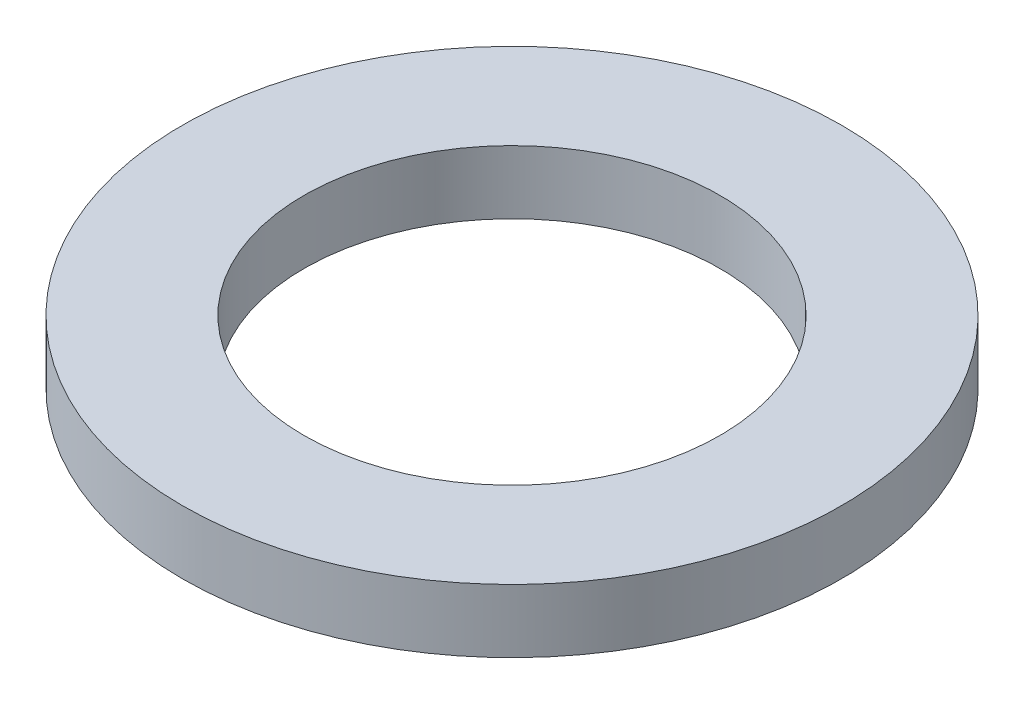
ISO-10303-21;
HEADER;
FILE_DESCRIPTION(('STEP AP214'),'2;1');
FILE_NAME('part.step','',(''),(''),'','','');
FILE_SCHEMA(('AUTOMOTIVE_DESIGN { 1 0 10303 214 1 1 1 1 }'));
ENDSEC;
DATA;
#1=APPLICATION_CONTEXT('core data for automotive mechanical design processes');
#2=APPLICATION_PROTOCOL_DEFINITION('international standard','automotive_design',2000,#1);
#3=PRODUCT_CONTEXT('',#1,'mechanical');
#4=PRODUCT('Part','Part','',(#3));
#5=PRODUCT_RELATED_PRODUCT_CATEGORY('part','',(#4));
#6=PRODUCT_DEFINITION_FORMATION('','',#4);
#7=PRODUCT_DEFINITION_CONTEXT('part definition',#1,'design');
#8=PRODUCT_DEFINITION('design','',#6,#7);
#9=PRODUCT_DEFINITION_SHAPE('','',#8);
#10=(LENGTH_UNIT() NAMED_UNIT(*) SI_UNIT(.MILLI.,.METRE.));
#11=(NAMED_UNIT(*) PLANE_ANGLE_UNIT() SI_UNIT($,.RADIAN.));
#12=(NAMED_UNIT(*) SI_UNIT($,.STERADIAN.) SOLID_ANGLE_UNIT());
#13=UNCERTAINTY_MEASURE_WITH_UNIT(LENGTH_MEASURE(1.E-05),#10,'distance_accuracy_value','');
#14=(GEOMETRIC_REPRESENTATION_CONTEXT(3) GLOBAL_UNCERTAINTY_ASSIGNED_CONTEXT((#13)) GLOBAL_UNIT_ASSIGNED_CONTEXT((#10,
#11,#12)) REPRESENTATION_CONTEXT('',''));
#15=CARTESIAN_POINT('',(0.,0.,0.));
#16=DIRECTION('',(0.,0.,1.));
#17=DIRECTION('',(1.,0.,0.));
#18=AXIS2_PLACEMENT_3D('',#15,#16,#17);
#19=CARTESIAN_POINT('',(0.,12.7,0.));
#20=DIRECTION('',(0.,1.,0.));
#21=DIRECTION('',(0.,0.,1.));
#22=AXIS2_PLACEMENT_3D('',#19,#20,#21);
#23=PLANE('',#22);
#24=CARTESIAN_POINT('',(0.,12.7,0.));
#25=DIRECTION('',(0.,1.,0.));
#26=DIRECTION('',(0.,0.,1.));
#27=AXIS2_PLACEMENT_3D('',#24,#25,#26);
#28=CIRCLE('',#27,66.04);
#29=CARTESIAN_POINT('',(0.,12.7,66.04));
#30=VERTEX_POINT('',#29);
#31=EDGE_CURVE('E10',#30,#30,#28,.T.);
#32=ORIENTED_EDGE('',*,*,#31,.T.);
#33=EDGE_LOOP('',(#32));
#34=FACE_BOUND('',#33,.T.);
#35=CARTESIAN_POINT('',(0.,12.7,0.));
#36=DIRECTION('',(0.,1.,0.));
#37=DIRECTION('',(0.,0.,1.));
#38=AXIS2_PLACEMENT_3D('',#35,#36,#37);
#39=CIRCLE('',#38,41.6814);
#40=CARTESIAN_POINT('',(0.,12.7,41.6814));
#41=VERTEX_POINT('',#40);
#42=EDGE_CURVE('E42',#41,#41,#39,.T.);
#43=ORIENTED_EDGE('',*,*,#42,.F.);
#44=EDGE_LOOP('',(#43));
#45=FACE_BOUND('',#44,.T.);
#46=ADVANCED_FACE('F31',(#34,#45),#23,.T.);
#47=CARTESIAN_POINT('',(0.,0.,0.));
#48=DIRECTION('',(0.,1.,0.));
#49=DIRECTION('',(0.,0.,1.));
#50=AXIS2_PLACEMENT_3D('',#47,#48,#49);
#51=PLANE('',#50);
#52=CARTESIAN_POINT('',(0.,0.,0.));
#53=DIRECTION('',(0.,1.,0.));
#54=DIRECTION('',(0.,0.,1.));
#55=AXIS2_PLACEMENT_3D('',#52,#53,#54);
#56=CIRCLE('',#55,66.04);
#57=CARTESIAN_POINT('',(0.,0.,66.04));
#58=VERTEX_POINT('',#57);
#59=EDGE_CURVE('E35',#58,#58,#56,.T.);
#60=ORIENTED_EDGE('',*,*,#59,.F.);
#61=EDGE_LOOP('',(#60));
#62=FACE_BOUND('',#61,.T.);
#63=CARTESIAN_POINT('',(0.,0.,0.));
#64=DIRECTION('',(0.,1.,0.));
#65=DIRECTION('',(0.,0.,1.));
#66=AXIS2_PLACEMENT_3D('',#63,#64,#65);
#67=CIRCLE('',#66,41.6814);
#68=CARTESIAN_POINT('',(0.,0.,41.6814));
#69=VERTEX_POINT('',#68);
#70=EDGE_CURVE('E44',#69,#69,#67,.T.);
#71=ORIENTED_EDGE('',*,*,#70,.T.);
#72=EDGE_LOOP('',(#71));
#73=FACE_BOUND('',#72,.T.);
#74=ADVANCED_FACE('F54',(#62,#73),#51,.F.);
#75=CARTESIAN_POINT('',(0.,12.7,0.));
#76=DIRECTION('',(0.,-1.,0.));
#77=DIRECTION('',(0.,0.,-1.));
#78=AXIS2_PLACEMENT_3D('',#75,#76,#77);
#79=CYLINDRICAL_SURFACE('',#78,66.04);
#80=ORIENTED_EDGE('',*,*,#31,.F.);
#81=EDGE_LOOP('',(#80));
#82=FACE_BOUND('',#81,.T.);
#83=ORIENTED_EDGE('',*,*,#59,.T.);
#84=EDGE_LOOP('',(#83));
#85=FACE_BOUND('',#84,.T.);
#86=ADVANCED_FACE('F33',(#82,#85),#79,.T.);
#87=CARTESIAN_POINT('',(0.,12.7,0.));
#88=DIRECTION('',(0.,-1.,0.));
#89=DIRECTION('',(0.,0.,-1.));
#90=AXIS2_PLACEMENT_3D('',#87,#88,#89);
#91=CYLINDRICAL_SURFACE('',#90,41.6814);
#92=ORIENTED_EDGE('',*,*,#42,.T.);
#93=EDGE_LOOP('',(#92));
#94=FACE_BOUND('',#93,.T.);
#95=ORIENTED_EDGE('',*,*,#70,.F.);
#96=EDGE_LOOP('',(#95));
#97=FACE_BOUND('',#96,.T.);
#98=ADVANCED_FACE('F50',(#94,#97),#91,.F.);
#99=CLOSED_SHELL('',(#46,#74,#86,#98));
#100=MANIFOLD_SOLID_BREP('B2',#99);
#101=ADVANCED_BREP_SHAPE_REPRESENTATION('',(#18,#100),#14);
#102=SHAPE_DEFINITION_REPRESENTATION(#9,#101);
ENDSEC;
END-ISO-10303-21;
